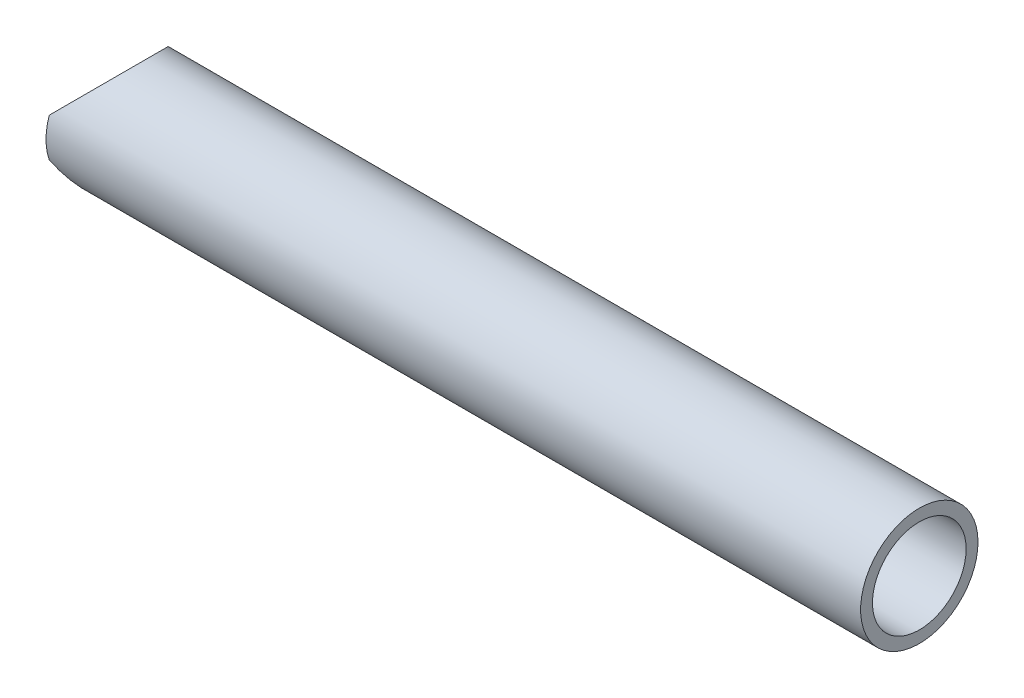
ISO-10303-21;
HEADER;
FILE_DESCRIPTION(('STEP AP214'),'2;1');
FILE_NAME('part.step','',(''),(''),'','','');
FILE_SCHEMA(('AUTOMOTIVE_DESIGN { 1 0 10303 214 1 1 1 1 }'));
ENDSEC;
DATA;
#1=APPLICATION_CONTEXT('core data for automotive mechanical design processes');
#2=APPLICATION_PROTOCOL_DEFINITION('international standard','automotive_design',2000,#1);
#3=PRODUCT_CONTEXT('',#1,'mechanical');
#4=PRODUCT('Part','Part','',(#3));
#5=PRODUCT_RELATED_PRODUCT_CATEGORY('part','',(#4));
#6=PRODUCT_DEFINITION_FORMATION('','',#4);
#7=PRODUCT_DEFINITION_CONTEXT('part definition',#1,'design');
#8=PRODUCT_DEFINITION('design','',#6,#7);
#9=PRODUCT_DEFINITION_SHAPE('','',#8);
#10=(LENGTH_UNIT() NAMED_UNIT(*) SI_UNIT(.MILLI.,.METRE.));
#11=(NAMED_UNIT(*) PLANE_ANGLE_UNIT() SI_UNIT($,.RADIAN.));
#12=(NAMED_UNIT(*) SI_UNIT($,.STERADIAN.) SOLID_ANGLE_UNIT());
#13=UNCERTAINTY_MEASURE_WITH_UNIT(LENGTH_MEASURE(1.E-05),#10,'distance_accuracy_value','');
#14=(GEOMETRIC_REPRESENTATION_CONTEXT(3) GLOBAL_UNCERTAINTY_ASSIGNED_CONTEXT((#13)) GLOBAL_UNIT_ASSIGNED_CONTEXT((#10,
#11,#12)) REPRESENTATION_CONTEXT('',''));
#15=CARTESIAN_POINT('',(0.,0.,0.));
#16=DIRECTION('',(0.,0.,1.));
#17=DIRECTION('',(1.,0.,0.));
#18=AXIS2_PLACEMENT_3D('',#15,#16,#17);
#19=CARTESIAN_POINT('',(0.,0.,0.));
#20=DIRECTION('',(1.,0.,0.));
#21=DIRECTION('',(0.,0.,-1.));
#22=AXIS2_PLACEMENT_3D('',#19,#20,#21);
#23=PLANE('',#22);
#24=DIRECTION('',(0.,1.,0.));
#25=VECTOR('',#24,1.);
#26=CARTESIAN_POINT('',(3.40005801291454E-13,-29.5656,15.7602855304083));
#27=LINE('',#26,#25);
#28=CARTESIAN_POINT('',(1.70002900645727E-13,5.52450000000017,15.7602855304083));
#29=VERTEX_POINT('',#28);
#30=CARTESIAN_POINT('',(1.70002900645727E-13,-5.52450000000017,15.7602855304083));
#31=VERTEX_POINT('',#30);
#32=EDGE_CURVE('E48',#29,#31,#27,.F.);
#33=ORIENTED_EDGE('',*,*,#32,.T.);
#34=CARTESIAN_POINT('',(0.,0.,0.));
#35=DIRECTION('',(1.,0.,0.));
#36=DIRECTION('',(0.,0.,-1.));
#37=AXIS2_PLACEMENT_3D('',#34,#35,#36);
#38=CIRCLE('',#37,16.7005);
#39=EDGE_CURVE('E52',#29,#31,#38,.T.);
#40=ORIENTED_EDGE('',*,*,#39,.F.);
#41=EDGE_LOOP('',(#33,#40));
#42=FACE_BOUND('',#41,.T.);
#43=ADVANCED_FACE('F16',(#42),#23,.F.);
#44=CARTESIAN_POINT('',(0.,0.,0.));
#45=DIRECTION('',(1.,0.,0.));
#46=DIRECTION('',(0.,0.,-1.));
#47=AXIS2_PLACEMENT_3D('',#44,#45,#46);
#48=CYLINDRICAL_SURFACE('',#47,13.3223);
#49=CARTESIAN_POINT('',(231.775,0.,0.));
#50=DIRECTION('',(1.,0.,0.));
#51=DIRECTION('',(0.,0.,-1.));
#52=AXIS2_PLACEMENT_3D('',#49,#50,#51);
#53=CIRCLE('',#52,13.3223);
#54=CARTESIAN_POINT('',(231.775,0.,-13.3223));
#55=VERTEX_POINT('',#54);
#56=EDGE_CURVE('E19',#55,#55,#53,.F.);
#57=ORIENTED_EDGE('',*,*,#56,.F.);
#58=EDGE_LOOP('',(#57));
#59=FACE_BOUND('',#58,.T.);
#60=CARTESIAN_POINT('',(11.176,-13.3223,0.));
#61=CARTESIAN_POINT('',(11.1760022726798,-13.3223023242645,0.320327611069018));
#62=CARTESIAN_POINT('',(11.1667666898259,-13.3107306853373,0.640627709853613));
#63=CARTESIAN_POINT('',(11.1300459858391,-13.2646551286551,1.27863725280054));
#64=CARTESIAN_POINT('',(11.102554501826,-13.2301432153324,1.59634575459573));
#65=CARTESIAN_POINT('',(11.0299124270415,-13.1387334332244,2.22687980403761));
#66=CARTESIAN_POINT('',(10.9847390592513,-13.0818066900848,2.53969851018662));
#67=CARTESIAN_POINT('',(10.8777523394132,-12.9465273757852,3.1577162469292));
#68=CARTESIAN_POINT('',(10.8159400720969,-12.8681762013326,3.46291577281947));
#69=CARTESIAN_POINT('',(10.6773958626076,-12.6917834304798,4.06192152083716));
#70=CARTESIAN_POINT('',(10.6007580899674,-12.5938659932446,4.355786305217));
#71=CARTESIAN_POINT('',(10.43377982613,-12.3793459221991,4.93256100668089));
#72=CARTESIAN_POINT('',(10.3434394052328,-12.2627433842504,5.21547097995799));
#73=CARTESIAN_POINT('',(10.1506222414082,-12.0121952600784,5.76915750606444));
#74=CARTESIAN_POINT('',(10.0481464137716,-11.878250981753,6.03993497184532));
#75=CARTESIAN_POINT('',(9.83264799652191,-11.5942880888503,6.56857876898173));
#76=CARTESIAN_POINT('',(9.71962325573317,-11.4442661947341,6.82644245036192));
#77=CARTESIAN_POINT('',(9.44388909592101,-11.0747292309753,7.41575222861923));
#78=CARTESIAN_POINT('',(9.27753953600405,-10.8491534771918,7.74171440886628));
#79=CARTESIAN_POINT('',(8.93254023942855,-10.3735150043499,8.36831513002783));
#80=CARTESIAN_POINT('',(8.75388660888692,-10.1234445227472,8.66894558663518));
#81=CARTESIAN_POINT('',(8.38774005655,-9.60012869089633,9.24516533113684));
#82=CARTESIAN_POINT('',(8.20022522955455,-9.32682441485728,9.52068703976544));
#83=CARTESIAN_POINT('',(7.82086456246452,-8.7590172712305,10.0455348659264));
#84=CARTESIAN_POINT('',(7.62901921214336,-8.46451679272699,10.294863927939));
#85=CARTESIAN_POINT('',(7.24236213967753,-7.85032592474213,10.770763352837));
#86=CARTESIAN_POINT('',(7.04755045923242,-7.53031622533669,10.996921775408));
#87=CARTESIAN_POINT('',(6.66308917719732,-6.86925540205078,11.4215314749742));
#88=CARTESIAN_POINT('',(6.4734412114144,-6.5281977196473,11.6199740522538));
#89=CARTESIAN_POINT('',(6.10622768163911,-5.82582600132603,11.9874995098759));
#90=CARTESIAN_POINT('',(5.92863007731337,-5.4645707470771,12.156662263707));
#91=CARTESIAN_POINT('',(5.59295358600149,-4.72067128779171,12.4643765893381));
#92=CARTESIAN_POINT('',(5.43485811330871,-4.33804566535483,12.6029542526934));
#93=CARTESIAN_POINT('',(5.20873934159882,-3.71805631198767,12.7951607298448));
#94=CARTESIAN_POINT('',(5.13089728140539,-3.48768470856634,12.8599318507156));
#95=CARTESIAN_POINT('',(4.98720208720498,-3.02031067029503,12.9776513437497));
#96=CARTESIAN_POINT('',(4.92134453612582,-2.78331071573124,13.0306040733961));
#97=CARTESIAN_POINT('',(4.80394496351162,-2.30383118665166,13.1238543749328));
#98=CARTESIAN_POINT('',(4.75237441216523,-2.06136359359564,13.1641771889436));
#99=CARTESIAN_POINT('',(4.66545521249966,-1.57168237835566,13.231574100355));
#100=CARTESIAN_POINT('',(4.63010637270494,-1.32446881222744,13.2586483541374));
#101=CARTESIAN_POINT('',(4.57704092116483,-0.824813717891811,13.2991244854138));
#102=CARTESIAN_POINT('',(4.55948110428878,-0.572345381894245,13.3124048067409));
#103=CARTESIAN_POINT('',(4.54344595237067,-0.0664598624381943,13.3245364031734));
#104=CARTESIAN_POINT('',(4.54496971596473,0.186957275640859,13.3233883597656));
#105=CARTESIAN_POINT('',(4.5670280184897,0.692666428117898,13.3066880828946));
#106=CARTESIAN_POINT('',(4.58757696802692,0.944957443963426,13.2911249307192));
#107=CARTESIAN_POINT('',(4.64665426994732,1.44614639821891,13.2459685722617));
#108=CARTESIAN_POINT('',(4.68518514233274,1.69504385601936,13.2163733995108));
#109=CARTESIAN_POINT('',(4.78593325057174,2.22728589583386,13.1379740688624));
#110=CARTESIAN_POINT('',(4.85095771293587,2.50975507849211,13.0868508518866));
#111=CARTESIAN_POINT('',(4.99939083829237,3.06614646864934,12.9677846498346));
#112=CARTESIAN_POINT('',(5.08280352026242,3.3400667927233,12.8998379873813));
#113=CARTESIAN_POINT('',(5.26465683157079,3.87910381747959,12.748130458391));
#114=CARTESIAN_POINT('',(5.36313371350755,4.14419735031212,12.6643313239352));
#115=CARTESIAN_POINT('',(5.57163838253155,4.66455646200999,12.4820514266048));
#116=CARTESIAN_POINT('',(5.68166708097062,4.91982126328746,12.3835695051103));
#117=CARTESIAN_POINT('',(5.96570035653311,5.54176335883849,12.1216807857137));
#118=CARTESIAN_POINT('',(6.14489541358393,5.90257029805164,11.9499195869986));
#119=CARTESIAN_POINT('',(6.51439397451726,6.60306418505249,11.5775922956243));
#120=CARTESIAN_POINT('',(6.70470250391487,6.94274143234262,11.3770131106519));
#121=CARTESIAN_POINT('',(7.09036806441432,7.60152721665838,10.9478375885538));
#122=CARTESIAN_POINT('',(7.2857306004054,7.9206118781442,10.719209590928));
#123=CARTESIAN_POINT('',(7.6760638219135,8.53749659886875,10.2346772688302));
#124=CARTESIAN_POINT('',(7.87103456619797,8.83530012459874,9.97877740367788));
#125=CARTESIAN_POINT('',(8.26096242417095,9.4161253845703,9.4330817250464));
#126=CARTESIAN_POINT('',(8.45579351549101,9.69857986569026,9.1425902851498));
#127=CARTESIAN_POINT('',(8.83575835051471,10.2386914673996,8.53337987046541));
#128=CARTESIAN_POINT('',(9.02089061522984,10.4963448110139,8.21465661038982));
#129=CARTESIAN_POINT('',(9.37658685588422,10.983947176741,7.55023368797616));
#130=CARTESIAN_POINT('',(9.54718000185147,11.2139520701998,7.20459083682884));
#131=CARTESIAN_POINT('',(9.86969419772823,11.6438124511925,6.4869142087132));
#132=CARTESIAN_POINT('',(10.0216241834005,11.8436823775984,6.11489319701754));
#133=CARTESIAN_POINT('',(10.2618610714634,12.1570200126236,5.45731588503974));
#134=CARTESIAN_POINT('',(10.3558801063601,12.2787819615008,5.17776613943705));
#135=CARTESIAN_POINT('',(10.5306410549498,12.5039826139171,4.60739043490351));
#136=CARTESIAN_POINT('',(10.6113862358935,12.6074258269492,4.3165672726775));
#137=CARTESIAN_POINT('',(10.757994430186,12.7945290817023,3.72553421346394));
#138=CARTESIAN_POINT('',(10.8238831308898,12.8782232819729,3.42534155613565));
#139=CARTESIAN_POINT('',(10.9396166674737,13.0248277193738,2.81698637408822));
#140=CARTESIAN_POINT('',(10.9894666241166,13.087744590346,2.50882642713711));
#141=CARTESIAN_POINT('',(11.0786628681905,13.2001272156586,1.83686321925604));
#142=CARTESIAN_POINT('',(11.1150634533872,13.2458441391274,1.47202802574653));
#143=CARTESIAN_POINT('',(11.1637336492671,13.3069328884286,0.7381170567501));
#144=CARTESIAN_POINT('',(11.1759973817106,13.3222973222814,0.369040270281562));
#145=CARTESIAN_POINT('',(11.1760022726798,13.3223023242645,-0.320327611069017));
#146=CARTESIAN_POINT('',(11.1667666898259,13.3107306853373,-0.640627709853614));
#147=CARTESIAN_POINT('',(11.1300459858391,13.2646551286551,-1.27863725280054));
#148=CARTESIAN_POINT('',(11.102554501826,13.2301432153324,-1.59634575459573));
#149=CARTESIAN_POINT('',(11.0299124270415,13.1387334332244,-2.22687980403761));
#150=CARTESIAN_POINT('',(10.9847390592513,13.0818066900848,-2.53969851018662));
#151=CARTESIAN_POINT('',(10.8777523394132,12.9465273757852,-3.1577162469292));
#152=CARTESIAN_POINT('',(10.8159400720969,12.8681762013326,-3.46291577281947));
#153=CARTESIAN_POINT('',(10.6773958626076,12.6917834304798,-4.06192152083716));
#154=CARTESIAN_POINT('',(10.6007580899674,12.5938659932446,-4.355786305217));
#155=CARTESIAN_POINT('',(10.43377982613,12.3793459221991,-4.93256100668089));
#156=CARTESIAN_POINT('',(10.3434394052328,12.2627433842504,-5.21547097995799));
#157=CARTESIAN_POINT('',(10.1506222414082,12.0121952600784,-5.76915750606443));
#158=CARTESIAN_POINT('',(10.0481464137717,11.878250981753,-6.03993497184531));
#159=CARTESIAN_POINT('',(9.83264799652192,11.5942880888503,-6.56857876898172));
#160=CARTESIAN_POINT('',(9.71962325573317,11.4442661947341,-6.82644245036192));
#161=CARTESIAN_POINT('',(9.44388909592101,11.0747292309754,-7.41575222861923));
#162=CARTESIAN_POINT('',(9.27753953600405,10.8491534771919,-7.74171440886628));
#163=CARTESIAN_POINT('',(8.93254023942855,10.3735150043499,-8.36831513002783));
#164=CARTESIAN_POINT('',(8.75388660888692,10.1234445227472,-8.66894558663518));
#165=CARTESIAN_POINT('',(8.38774005655,9.60012869089633,-9.24516533113683));
#166=CARTESIAN_POINT('',(8.20022522955454,9.32682441485728,-9.52068703976544));
#167=CARTESIAN_POINT('',(7.82086456246453,8.75901727123051,-10.0455348659264));
#168=CARTESIAN_POINT('',(7.62901921214337,8.46451679272699,-10.294863927939));
#169=CARTESIAN_POINT('',(7.24236213967753,7.85032592474213,-10.770763352837));
#170=CARTESIAN_POINT('',(7.04755045923241,7.53031622533669,-10.996921775408));
#171=CARTESIAN_POINT('',(6.66308917719731,6.86925540205078,-11.4215314749742));
#172=CARTESIAN_POINT('',(6.47344121141441,6.5281977196473,-11.6199740522538));
#173=CARTESIAN_POINT('',(6.10622768163911,5.82582600132603,-11.9874995098759));
#174=CARTESIAN_POINT('',(5.92863007731337,5.4645707470771,-12.156662263707));
#175=CARTESIAN_POINT('',(5.59295358600148,4.72067128779172,-12.4643765893381));
#176=CARTESIAN_POINT('',(5.43485811330871,4.33804566535484,-12.6029542526934));
#177=CARTESIAN_POINT('',(5.20873934159883,3.71805631198767,-12.7951607298448));
#178=CARTESIAN_POINT('',(5.1308972814054,3.48768470856635,-12.8599318507156));
#179=CARTESIAN_POINT('',(4.98720208720499,3.02031067029504,-12.9776513437497));
#180=CARTESIAN_POINT('',(4.92134453612582,2.78331071573125,-13.0306040733961));
#181=CARTESIAN_POINT('',(4.80394496351162,2.30383118665167,-13.1238543749328));
#182=CARTESIAN_POINT('',(4.75237441216523,2.06136359359564,-13.1641771889436));
#183=CARTESIAN_POINT('',(4.66545521249966,1.57168237835567,-13.231574100355));
#184=CARTESIAN_POINT('',(4.63010637270494,1.32446881222744,-13.2586483541374));
#185=CARTESIAN_POINT('',(4.57704092116483,0.824813717891814,-13.2991244854138));
#186=CARTESIAN_POINT('',(4.55948110428878,0.572345381894248,-13.3124048067409));
#187=CARTESIAN_POINT('',(4.54344595237068,0.0664598624381978,-13.3245364031734));
#188=CARTESIAN_POINT('',(4.54496971596474,-0.186957275640855,-13.3233883597656));
#189=CARTESIAN_POINT('',(4.5670280184897,-0.692666428117897,-13.3066880828946));
#190=CARTESIAN_POINT('',(4.58757696802692,-0.944957443963428,-13.2911249307192));
#191=CARTESIAN_POINT('',(4.64665426994732,-1.44614639821891,-13.2459685722617));
#192=CARTESIAN_POINT('',(4.68518514233274,-1.69504385601936,-13.2163733995108));
#193=CARTESIAN_POINT('',(4.78593325057174,-2.22728589583386,-13.1379740688624));
#194=CARTESIAN_POINT('',(4.85095771293587,-2.50975507849211,-13.0868508518866));
#195=CARTESIAN_POINT('',(4.99939083829237,-3.06614646864933,-12.9677846498346));
#196=CARTESIAN_POINT('',(5.08280352026242,-3.3400667927233,-12.8998379873813));
#197=CARTESIAN_POINT('',(5.26465683157079,-3.87910381747959,-12.748130458391));
#198=CARTESIAN_POINT('',(5.36313371350755,-4.14419735031212,-12.6643313239352));
#199=CARTESIAN_POINT('',(5.57163838253155,-4.66455646200999,-12.4820514266048));
#200=CARTESIAN_POINT('',(5.68166708097063,-4.91982126328746,-12.3835695051103));
#201=CARTESIAN_POINT('',(5.96570035653311,-5.54176335883849,-12.1216807857137));
#202=CARTESIAN_POINT('',(6.14489541358393,-5.90257029805164,-11.9499195869986));
#203=CARTESIAN_POINT('',(6.51439397451726,-6.60306418505249,-11.5775922956243));
#204=CARTESIAN_POINT('',(6.70470250391487,-6.94274143234261,-11.3770131106519));
#205=CARTESIAN_POINT('',(7.09036806441432,-7.60152721665837,-10.9478375885538));
#206=CARTESIAN_POINT('',(7.2857306004054,-7.9206118781442,-10.719209590928));
#207=CARTESIAN_POINT('',(7.6760638219135,-8.53749659886875,-10.2346772688302));
#208=CARTESIAN_POINT('',(7.87103456619797,-8.83530012459874,-9.97877740367788));
#209=CARTESIAN_POINT('',(8.26096242417095,-9.4161253845703,-9.4330817250464));
#210=CARTESIAN_POINT('',(8.45579351549101,-9.69857986569026,-9.1425902851498));
#211=CARTESIAN_POINT('',(8.83575835051471,-10.2386914673996,-8.53337987046541));
#212=CARTESIAN_POINT('',(9.02089061522984,-10.4963448110139,-8.21465661038981));
#213=CARTESIAN_POINT('',(9.37658685588422,-10.983947176741,-7.55023368797615));
#214=CARTESIAN_POINT('',(9.54718000185148,-11.2139520701998,-7.20459083682883));
#215=CARTESIAN_POINT('',(9.86969419772823,-11.6438124511925,-6.48691420871319));
#216=CARTESIAN_POINT('',(10.0216241834005,-11.8436823775984,-6.11489319701754));
#217=CARTESIAN_POINT('',(10.2618610714634,-12.1570200126236,-5.45731588503974));
#218=CARTESIAN_POINT('',(10.3558801063601,-12.2787819615008,-5.17776613943705));
#219=CARTESIAN_POINT('',(10.5306410549498,-12.5039826139171,-4.60739043490351));
#220=CARTESIAN_POINT('',(10.6113862358935,-12.6074258269492,-4.3165672726775));
#221=CARTESIAN_POINT('',(10.757994430186,-12.7945290817023,-3.72553421346394));
#222=CARTESIAN_POINT('',(10.8238831308898,-12.8782232819729,-3.42534155613565));
#223=CARTESIAN_POINT('',(10.9396166674737,-13.0248277193738,-2.81698637408821));
#224=CARTESIAN_POINT('',(10.9894666241166,-13.087744590346,-2.50882642713711));
#225=CARTESIAN_POINT('',(11.0786628681905,-13.2001272156586,-1.83686321925604));
#226=CARTESIAN_POINT('',(11.1150634533872,-13.2458441391274,-1.47202802574653));
#227=CARTESIAN_POINT('',(11.1637336492671,-13.3069328884286,-0.7381170567501));
#228=CARTESIAN_POINT('',(11.1759973817106,-13.3222973222814,-0.369040270281561));
#229=CARTESIAN_POINT('',(11.176,-13.3223,0.));
#230=B_SPLINE_CURVE_WITH_KNOTS('',3,(#60,#61,#62,#63,#64,#65,#66,#67,#68,#69,#70,#71,#72,#73,
#74,#75,#76,#77,#78,#79,#80,#81,#82,#83,#84,#85,#86,#87,#88,#89,#90,#91,#92,#93,#94,#95,#96,#97,
#98,#99,#100,#101,#102,#103,#104,#105,#106,#107,#108,#109,#110,#111,#112,#113,#114,#115,#116,
#117,#118,#119,#120,#121,#122,#123,#124,#125,#126,#127,#128,#129,#130,#131,#132,#133,#134,#135,
#136,#137,#138,#139,#140,#141,#142,#143,#144,#145,#146,#147,#148,#149,#150,#151,#152,#153,#154,
#155,#156,#157,#158,#159,#160,#161,#162,#163,#164,#165,#166,#167,#168,#169,#170,#171,#172,#173,
#174,#175,#176,#177,#178,#179,#180,#181,#182,#183,#184,#185,#186,#187,#188,#189,#190,#191,#192,
#193,#194,#195,#196,#197,#198,#199,#200,#201,#202,#203,#204,#205,#206,#207,#208,#209,#210,#211,
#212,#213,#214,#215,#216,#217,#218,#219,#220,#221,#222,#223,#224,#225,#226,#227,#228,#229),
.UNSPECIFIED.,.T.,.F.,(4,2,2,2,2,2,2,2,2,2,2,2,2,2,2,2,2,2,2,2,2,2,2,2,2,2,2,2,2,2,2,2,2,2,2,2,
2,2,2,2,2,2,2,2,2,2,2,2,2,2,2,2,2,2,2,2,2,2,2,2,2,2,2,2,2,2,2,2,2,2,2,2,2,2,2,2,2,2,2,2,2,2,2,2,
4),(0.,0.96059688437499,1.92152874938144,2.88370253956848,3.8458136184125,4.80200307312237,
5.75818762237965,6.71430009904513,7.67060797768067,8.95846321786435,10.2467279166807,
11.5383634041269,12.8298535349705,14.1413312220722,15.4532196476233,16.7614709038919,
18.0686017648712,18.8229988182176,19.5771172614755,20.329718763709,21.0823113822627,
21.8414812059921,22.6006151724205,23.3603246148767,24.120140555657,25.0017814907899,
25.8836153110696,26.7676056921604,27.6516658659532,28.9635895987628,30.2761112480917,
31.5901282967294,32.9039308144814,34.2510891863135,35.5984523939142,36.9430454027011,
38.2869921015505,39.2433414937368,40.1994551347227,41.1539027250971,42.1080452815653,
43.2144520331022,44.3211282033465,45.2817250877215,46.242656952728,47.204830742915,
48.166941821759,49.1231312764689,50.0793158257262,51.0354283023917,51.9917361810272,
53.2795914212109,54.5678561200272,55.8594916074735,57.150981738317,58.4624594254187,
59.7743478509698,61.0825991072384,62.3897299682177,63.1441270215641,63.8982454648221,
64.6508469670555,65.4034395856092,66.1626094093386,66.921743375767,67.6814528182233,
68.4412687590035,69.3229096941365,70.2047435144162,71.0887338955069,71.9727940692998,
73.2847178021094,74.5972394514382,75.911256500076,77.225059017828,78.5722173896601,
79.9195805972608,81.2641736060476,82.608120304897,83.5644696970833,84.5205833380693,
85.4750309284436,86.4291734849118,87.5355802364488,88.6422564066931),.UNSPECIFIED.);
#231=CARTESIAN_POINT('',(11.176,-13.3223,0.));
#232=VERTEX_POINT('',#231);
#233=EDGE_CURVE('E57',#232,#232,#230,.T.);
#234=ORIENTED_EDGE('',*,*,#233,.T.);
#235=EDGE_LOOP('',(#234));
#236=FACE_BOUND('',#235,.T.);
#237=ADVANCED_FACE('F63',(#59,#236),#48,.F.);
#238=CARTESIAN_POINT('',(231.775,0.,0.));
#239=DIRECTION('',(1.,0.,0.));
#240=DIRECTION('',(0.,0.,-1.));
#241=AXIS2_PLACEMENT_3D('',#238,#239,#240);
#242=PLANE('',#241);
#243=ORIENTED_EDGE('',*,*,#56,.T.);
#244=EDGE_LOOP('',(#243));
#245=FACE_BOUND('',#244,.T.);
#246=CARTESIAN_POINT('',(231.775,0.,0.));
#247=DIRECTION('',(1.,0.,0.));
#248=DIRECTION('',(0.,0.,-1.));
#249=AXIS2_PLACEMENT_3D('',#246,#247,#248);
#250=CIRCLE('',#249,16.7005);
#251=CARTESIAN_POINT('',(231.775,0.,-16.7005));
#252=VERTEX_POINT('',#251);
#253=EDGE_CURVE('E49',#252,#252,#250,.F.);
#254=ORIENTED_EDGE('',*,*,#253,.F.);
#255=EDGE_LOOP('',(#254));
#256=FACE_BOUND('',#255,.T.);
#257=ADVANCED_FACE('F73',(#245,#256),#242,.T.);
#258=CARTESIAN_POINT('',(0.,0.,0.));
#259=DIRECTION('',(1.,0.,0.));
#260=DIRECTION('',(0.,0.,-1.));
#261=AXIS2_PLACEMENT_3D('',#258,#259,#260);
#262=PLANE('',#261);
#263=DIRECTION('',(0.,1.,0.));
#264=VECTOR('',#263,1.);
#265=CARTESIAN_POINT('',(3.39138439553466E-13,-29.5656,-15.7602855304083));
#266=LINE('',#265,#264);
#267=CARTESIAN_POINT('',(1.69569219776733E-13,-5.52450000000017,-15.7602855304083));
#268=VERTEX_POINT('',#267);
#269=CARTESIAN_POINT('',(1.69569219776733E-13,5.52450000000017,-15.7602855304083));
#270=VERTEX_POINT('',#269);
#271=EDGE_CURVE('E33',#268,#270,#266,.T.);
#272=ORIENTED_EDGE('',*,*,#271,.T.);
#273=CARTESIAN_POINT('',(0.,0.,0.));
#274=DIRECTION('',(1.,0.,0.));
#275=DIRECTION('',(0.,0.,-1.));
#276=AXIS2_PLACEMENT_3D('',#273,#274,#275);
#277=CIRCLE('',#276,16.7005);
#278=EDGE_CURVE('E25',#268,#270,#277,.T.);
#279=ORIENTED_EDGE('',*,*,#278,.F.);
#280=EDGE_LOOP('',(#272,#279));
#281=FACE_BOUND('',#280,.T.);
#282=ADVANCED_FACE('F70',(#281),#262,.F.);
#283=CARTESIAN_POINT('',(-5.5245,-29.5656,0.));
#284=DIRECTION('',(0.,1.,0.));
#285=DIRECTION('',(0.,0.,1.));
#286=AXIS2_PLACEMENT_3D('',#283,#284,#285);
#287=CYLINDRICAL_SURFACE('',#286,16.7005);
#288=ORIENTED_EDGE('',*,*,#233,.F.);
#289=EDGE_LOOP('',(#288));
#290=FACE_BOUND('',#289,.T.);
#291=CARTESIAN_POINT('',(-5.5245,0.,0.));
#292=DIRECTION('',(0.707106781186547,0.707106781186547,0.));
#293=DIRECTION('',(-0.707106781186547,0.707106781186547,0.));
#294=AXIS2_PLACEMENT_3D('',#291,#292,#293);
#295=ELLIPSE('',#294,23.6180735984119,16.7005);
#296=EDGE_CURVE('E45',#31,#268,#295,.T.);
#297=ORIENTED_EDGE('',*,*,#296,.F.);
#298=ORIENTED_EDGE('',*,*,#32,.F.);
#299=CARTESIAN_POINT('',(-5.5245,0.,0.));
#300=DIRECTION('',(-0.707106781186547,0.707106781186547,0.));
#301=DIRECTION('',(0.707106781186547,0.707106781186547,0.));
#302=AXIS2_PLACEMENT_3D('',#299,#300,#301);
#303=ELLIPSE('',#302,23.6180735984119,16.7005);
#304=EDGE_CURVE('E11',#270,#29,#303,.F.);
#305=ORIENTED_EDGE('',*,*,#304,.F.);
#306=ORIENTED_EDGE('',*,*,#271,.F.);
#307=EDGE_LOOP('',(#297,#298,#305,#306));
#308=FACE_BOUND('',#307,.T.);
#309=ADVANCED_FACE('F47',(#290,#308),#287,.F.);
#310=CARTESIAN_POINT('',(0.,0.,0.));
#311=DIRECTION('',(1.,0.,0.));
#312=DIRECTION('',(0.,0.,-1.));
#313=AXIS2_PLACEMENT_3D('',#310,#311,#312);
#314=CYLINDRICAL_SURFACE('',#313,16.7005);
#315=ORIENTED_EDGE('',*,*,#253,.T.);
#316=EDGE_LOOP('',(#315));
#317=FACE_BOUND('',#316,.T.);
#318=ORIENTED_EDGE('',*,*,#278,.T.);
#319=ORIENTED_EDGE('',*,*,#304,.T.);
#320=ORIENTED_EDGE('',*,*,#39,.T.);
#321=ORIENTED_EDGE('',*,*,#296,.T.);
#322=EDGE_LOOP('',(#318,#319,#320,#321));
#323=FACE_BOUND('',#322,.T.);
#324=ADVANCED_FACE('F54',(#317,#323),#314,.T.);
#325=CLOSED_SHELL('',(#43,#237,#257,#282,#309,#324));
#326=MANIFOLD_SOLID_BREP('B1',#325);
#327=ADVANCED_BREP_SHAPE_REPRESENTATION('',(#18,#326),#14);
#328=SHAPE_DEFINITION_REPRESENTATION(#9,#327);
ENDSEC;
END-ISO-10303-21;
